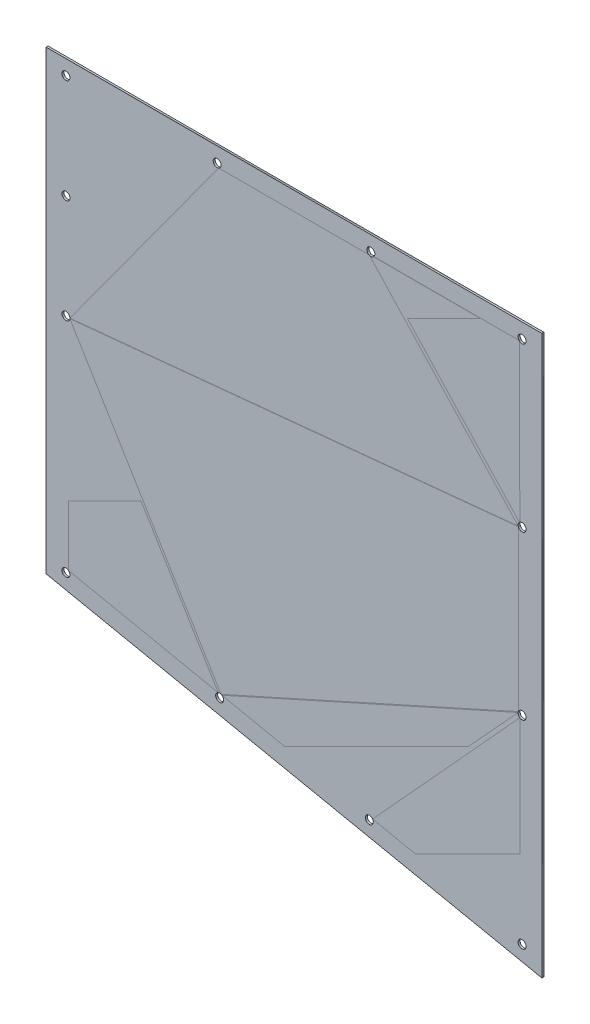
ISO-10303-21;
HEADER;
FILE_DESCRIPTION(('STEP AP214'),'2;1');
FILE_NAME('part.step','',(''),(''),'','','');
FILE_SCHEMA(('AUTOMOTIVE_DESIGN { 1 0 10303 214 1 1 1 1 }'));
ENDSEC;
DATA;
#1=APPLICATION_CONTEXT('core data for automotive mechanical design processes');
#2=APPLICATION_PROTOCOL_DEFINITION('international standard','automotive_design',2000,#1);
#3=PRODUCT_CONTEXT('',#1,'mechanical');
#4=PRODUCT('Part','Part','',(#3));
#5=PRODUCT_RELATED_PRODUCT_CATEGORY('part','',(#4));
#6=PRODUCT_DEFINITION_FORMATION('','',#4);
#7=PRODUCT_DEFINITION_CONTEXT('part definition',#1,'design');
#8=PRODUCT_DEFINITION('design','',#6,#7);
#9=PRODUCT_DEFINITION_SHAPE('','',#8);
#10=(LENGTH_UNIT() NAMED_UNIT(*) SI_UNIT(.MILLI.,.METRE.));
#11=(NAMED_UNIT(*) PLANE_ANGLE_UNIT() SI_UNIT($,.RADIAN.));
#12=(NAMED_UNIT(*) SI_UNIT($,.STERADIAN.) SOLID_ANGLE_UNIT());
#13=UNCERTAINTY_MEASURE_WITH_UNIT(LENGTH_MEASURE(1.E-05),#10,'distance_accuracy_value','');
#14=(GEOMETRIC_REPRESENTATION_CONTEXT(3) GLOBAL_UNCERTAINTY_ASSIGNED_CONTEXT((#13)) GLOBAL_UNIT_ASSIGNED_CONTEXT((#10,
#11,#12)) REPRESENTATION_CONTEXT('',''));
#15=CARTESIAN_POINT('',(0.,0.,0.));
#16=DIRECTION('',(0.,0.,1.));
#17=DIRECTION('',(1.,0.,0.));
#18=AXIS2_PLACEMENT_3D('',#15,#16,#17);
#19=CARTESIAN_POINT('',(-250.,0.,2.));
#20=DIRECTION('',(1.,0.,0.));
#21=DIRECTION('',(0.,1.,0.));
#22=AXIS2_PLACEMENT_3D('',#19,#20,#21);
#23=PLANE('',#22);
#24=DIRECTION('',(0.,-1.,0.));
#25=VECTOR('',#24,1.);
#26=CARTESIAN_POINT('',(-250.,0.,0.));
#27=LINE('',#26,#25);
#28=CARTESIAN_POINT('',(-250.,0.,0.));
#29=VERTEX_POINT('',#28);
#30=CARTESIAN_POINT('',(-250.,-460.,0.));
#31=VERTEX_POINT('',#30);
#32=EDGE_CURVE('E105',#29,#31,#27,.T.);
#33=ORIENTED_EDGE('',*,*,#32,.T.);
#34=DIRECTION('',(0.,0.,-1.));
#35=VECTOR('',#34,1.);
#36=CARTESIAN_POINT('',(-250.,-460.,2.));
#37=LINE('',#36,#35);
#38=CARTESIAN_POINT('',(-250.,-460.,2.));
#39=VERTEX_POINT('',#38);
#40=EDGE_CURVE('E12',#39,#31,#37,.T.);
#41=ORIENTED_EDGE('',*,*,#40,.F.);
#42=DIRECTION('',(0.,-1.,0.));
#43=VECTOR('',#42,1.);
#44=CARTESIAN_POINT('',(-250.,0.,2.));
#45=LINE('',#44,#43);
#46=CARTESIAN_POINT('',(-250.,0.,2.));
#47=VERTEX_POINT('',#46);
#48=EDGE_CURVE('E93',#47,#39,#45,.T.);
#49=ORIENTED_EDGE('',*,*,#48,.F.);
#50=DIRECTION('',(0.,0.,-1.));
#51=VECTOR('',#50,1.);
#52=CARTESIAN_POINT('',(-250.,0.,2.));
#53=LINE('',#52,#51);
#54=EDGE_CURVE('E101',#47,#29,#53,.T.);
#55=ORIENTED_EDGE('',*,*,#54,.T.);
#56=EDGE_LOOP('',(#33,#41,#49,#55));
#57=FACE_BOUND('',#56,.T.);
#58=ADVANCED_FACE('F42',(#57),#23,.F.);
#59=CARTESIAN_POINT('',(-250.,-460.,2.));
#60=DIRECTION('',(0.201763461346261,0.97943427837991,0.));
#61=DIRECTION('',(-0.97943427837991,0.201763461346261,0.));
#62=AXIS2_PLACEMENT_3D('',#59,#60,#61);
#63=PLANE('',#62);
#64=DIRECTION('',(0.97943427837991,-0.201763461346261,0.));
#65=VECTOR('',#64,1.);
#66=CARTESIAN_POINT('',(-250.,-460.,0.));
#67=LINE('',#66,#65);
#68=CARTESIAN_POINT('',(250.,-563.,0.));
#69=VERTEX_POINT('',#68);
#70=EDGE_CURVE('E97',#31,#69,#67,.T.);
#71=ORIENTED_EDGE('',*,*,#70,.T.);
#72=DIRECTION('',(0.,0.,-1.));
#73=VECTOR('',#72,1.);
#74=CARTESIAN_POINT('',(250.,-563.,2.));
#75=LINE('',#74,#73);
#76=CARTESIAN_POINT('',(250.,-563.,2.));
#77=VERTEX_POINT('',#76);
#78=EDGE_CURVE('E50',#77,#69,#75,.T.);
#79=ORIENTED_EDGE('',*,*,#78,.F.);
#80=DIRECTION('',(0.97943427837991,-0.201763461346261,0.));
#81=VECTOR('',#80,1.);
#82=CARTESIAN_POINT('',(-250.,-460.,2.));
#83=LINE('',#82,#81);
#84=EDGE_CURVE('E88',#39,#77,#83,.T.);
#85=ORIENTED_EDGE('',*,*,#84,.F.);
#86=ORIENTED_EDGE('',*,*,#40,.T.);
#87=EDGE_LOOP('',(#71,#79,#85,#86));
#88=FACE_BOUND('',#87,.T.);
#89=ADVANCED_FACE('F96',(#88),#63,.F.);
#90=CARTESIAN_POINT('',(250.,0.,2.));
#91=DIRECTION('',(-1.,0.,0.));
#92=DIRECTION('',(0.,-1.,0.));
#93=AXIS2_PLACEMENT_3D('',#90,#91,#92);
#94=PLANE('',#93);
#95=DIRECTION('',(0.,1.,0.));
#96=VECTOR('',#95,1.);
#97=CARTESIAN_POINT('',(250.,0.,0.));
#98=LINE('',#97,#96);
#99=CARTESIAN_POINT('',(250.,0.,0.));
#100=VERTEX_POINT('',#99);
#101=EDGE_CURVE('E75',#69,#100,#98,.T.);
#102=ORIENTED_EDGE('',*,*,#101,.T.);
#103=DIRECTION('',(0.,0.,-1.));
#104=VECTOR('',#103,1.);
#105=CARTESIAN_POINT('',(250.,0.,2.));
#106=LINE('',#105,#104);
#107=CARTESIAN_POINT('',(250.,0.,2.));
#108=VERTEX_POINT('',#107);
#109=EDGE_CURVE('E98',#108,#100,#106,.T.);
#110=ORIENTED_EDGE('',*,*,#109,.F.);
#111=DIRECTION('',(0.,1.,0.));
#112=VECTOR('',#111,1.);
#113=CARTESIAN_POINT('',(250.,0.,2.));
#114=LINE('',#113,#112);
#115=EDGE_CURVE('E91',#77,#108,#114,.T.);
#116=ORIENTED_EDGE('',*,*,#115,.F.);
#117=ORIENTED_EDGE('',*,*,#78,.T.);
#118=EDGE_LOOP('',(#102,#110,#116,#117));
#119=FACE_BOUND('',#118,.T.);
#120=ADVANCED_FACE('F99',(#119),#94,.F.);
#121=CARTESIAN_POINT('',(-250.,0.,2.));
#122=DIRECTION('',(0.,-1.,0.));
#123=DIRECTION('',(0.,0.,-1.));
#124=AXIS2_PLACEMENT_3D('',#121,#122,#123);
#125=PLANE('',#124);
#126=DIRECTION('',(-1.,0.,0.));
#127=VECTOR('',#126,1.);
#128=CARTESIAN_POINT('',(-250.,0.,0.));
#129=LINE('',#128,#127);
#130=EDGE_CURVE('E81',#100,#29,#129,.T.);
#131=ORIENTED_EDGE('',*,*,#130,.T.);
#132=ORIENTED_EDGE('',*,*,#54,.F.);
#133=DIRECTION('',(-1.,0.,0.));
#134=VECTOR('',#133,1.);
#135=CARTESIAN_POINT('',(-250.,0.,2.));
#136=LINE('',#135,#134);
#137=EDGE_CURVE('E58',#108,#47,#136,.T.);
#138=ORIENTED_EDGE('',*,*,#137,.F.);
#139=ORIENTED_EDGE('',*,*,#109,.T.);
#140=EDGE_LOOP('',(#131,#132,#138,#139));
#141=FACE_BOUND('',#140,.T.);
#142=ADVANCED_FACE('F113',(#141),#125,.F.);
#143=CARTESIAN_POINT('',(0.,0.,2.));
#144=DIRECTION('',(0.,0.,1.));
#145=DIRECTION('',(1.,0.,0.));
#146=AXIS2_PLACEMENT_3D('',#143,#144,#145);
#147=PLANE('',#146);
#148=CARTESIAN_POINT('',(-230.,-448.805036728741,2.));
#149=DIRECTION('',(0.,0.,1.));
#150=DIRECTION('',(1.,0.,0.));
#151=AXIS2_PLACEMENT_3D('',#148,#149,#150);
#152=CIRCLE('',#151,4.00000000000002);
#153=CARTESIAN_POINT('',(-226.,-448.805036728741,2.));
#154=VERTEX_POINT('',#153);
#155=EDGE_CURVE('E184',#154,#154,#152,.T.);
#156=ORIENTED_EDGE('',*,*,#155,.F.);
#157=EDGE_LOOP('',(#156));
#158=FACE_BOUND('',#157,.T.);
#159=CARTESIAN_POINT('',(230.,-179.282518364371,2.));
#160=DIRECTION('',(0.,0.,1.));
#161=DIRECTION('',(1.,0.,0.));
#162=AXIS2_PLACEMENT_3D('',#159,#160,#161);
#163=CIRCLE('',#162,3.99999999999999);
#164=CARTESIAN_POINT('',(234.,-179.282518364371,2.));
#165=VERTEX_POINT('',#164);
#166=EDGE_CURVE('E178',#165,#165,#163,.T.);
#167=ORIENTED_EDGE('',*,*,#166,.F.);
#168=EDGE_LOOP('',(#167));
#169=FACE_BOUND('',#168,.T.);
#170=CARTESIAN_POINT('',(230.,-343.565036728742,2.));
#171=DIRECTION('',(0.,0.,1.));
#172=DIRECTION('',(1.,0.,0.));
#173=AXIS2_PLACEMENT_3D('',#170,#171,#172);
#174=CIRCLE('',#173,3.99999999999999);
#175=CARTESIAN_POINT('',(234.,-343.565036728742,2.));
#176=VERTEX_POINT('',#175);
#177=EDGE_CURVE('E172',#176,#176,#174,.T.);
#178=ORIENTED_EDGE('',*,*,#177,.F.);
#179=EDGE_LOOP('',(#178));
#180=FACE_BOUND('',#179,.T.);
#181=CARTESIAN_POINT('',(230.,-543.565036728741,2.));
#182=DIRECTION('',(0.,0.,1.));
#183=DIRECTION('',(1.,0.,0.));
#184=AXIS2_PLACEMENT_3D('',#181,#182,#183);
#185=CIRCLE('',#184,3.99999999999999);
#186=CARTESIAN_POINT('',(234.,-543.565036728741,2.));
#187=VERTEX_POINT('',#186);
#188=EDGE_CURVE('E166',#187,#187,#185,.T.);
#189=ORIENTED_EDGE('',*,*,#188,.F.);
#190=EDGE_LOOP('',(#189));
#191=FACE_BOUND('',#190,.T.);
#192=CARTESIAN_POINT('',(75.9604418380151,-511.832887747373,2.));
#193=DIRECTION('',(0.,0.,1.));
#194=DIRECTION('',(1.,0.,0.));
#195=AXIS2_PLACEMENT_3D('',#192,#193,#194);
#196=CIRCLE('',#195,4.00000000000001);
#197=CARTESIAN_POINT('',(79.9604418380151,-511.832887747373,2.));
#198=VERTEX_POINT('',#197);
#199=EDGE_CURVE('E160',#198,#198,#196,.T.);
#200=ORIENTED_EDGE('',*,*,#199,.F.);
#201=EDGE_LOOP('',(#200));
#202=FACE_BOUND('',#201,.T.);
#203=CARTESIAN_POINT('',(-75.0000000000001,-480.735036728741,2.));
#204=DIRECTION('',(0.,0.,1.));
#205=DIRECTION('',(1.,0.,0.));
#206=AXIS2_PLACEMENT_3D('',#203,#204,#205);
#207=CIRCLE('',#206,4.00000000000001);
#208=CARTESIAN_POINT('',(-71.0000000000001,-480.735036728741,2.));
#209=VERTEX_POINT('',#208);
#210=EDGE_CURVE('E154',#209,#209,#207,.T.);
#211=ORIENTED_EDGE('',*,*,#210,.F.);
#212=EDGE_LOOP('',(#211));
#213=FACE_BOUND('',#212,.T.);
#214=CARTESIAN_POINT('',(-230.,-224.715402175545,2.));
#215=DIRECTION('',(0.,0.,1.));
#216=DIRECTION('',(1.,0.,0.));
#217=AXIS2_PLACEMENT_3D('',#214,#215,#216);
#218=CIRCLE('',#217,3.99999999999999);
#219=CARTESIAN_POINT('',(-226.,-224.715402175545,2.));
#220=VERTEX_POINT('',#219);
#221=EDGE_CURVE('E148',#220,#220,#218,.T.);
#222=ORIENTED_EDGE('',*,*,#221,.F.);
#223=EDGE_LOOP('',(#222));
#224=FACE_BOUND('',#223,.T.);
#225=CARTESIAN_POINT('',(-230.,-119.857701087773,2.));
#226=DIRECTION('',(0.,0.,1.));
#227=DIRECTION('',(1.,0.,0.));
#228=AXIS2_PLACEMENT_3D('',#225,#226,#227);
#229=CIRCLE('',#228,4.00000000000002);
#230=CARTESIAN_POINT('',(-226.,-119.857701087773,2.));
#231=VERTEX_POINT('',#230);
#232=EDGE_CURVE('E142',#231,#231,#229,.T.);
#233=ORIENTED_EDGE('',*,*,#232,.F.);
#234=EDGE_LOOP('',(#233));
#235=FACE_BOUND('',#234,.T.);
#236=CARTESIAN_POINT('',(-230.,-15.,2.));
#237=DIRECTION('',(0.,0.,1.));
#238=DIRECTION('',(1.,0.,0.));
#239=AXIS2_PLACEMENT_3D('',#236,#237,#238);
#240=CIRCLE('',#239,3.99999999999999);
#241=CARTESIAN_POINT('',(-226.,-15.,2.));
#242=VERTEX_POINT('',#241);
#243=EDGE_CURVE('E136',#242,#242,#240,.T.);
#244=ORIENTED_EDGE('',*,*,#243,.F.);
#245=EDGE_LOOP('',(#244));
#246=FACE_BOUND('',#245,.T.);
#247=CARTESIAN_POINT('',(-77.5,-15.,2.));
#248=DIRECTION('',(0.,0.,1.));
#249=DIRECTION('',(1.,0.,0.));
#250=AXIS2_PLACEMENT_3D('',#247,#248,#249);
#251=CIRCLE('',#250,4.00000000000001);
#252=CARTESIAN_POINT('',(-73.5,-15.,2.));
#253=VERTEX_POINT('',#252);
#254=EDGE_CURVE('E130',#253,#253,#251,.T.);
#255=ORIENTED_EDGE('',*,*,#254,.F.);
#256=EDGE_LOOP('',(#255));
#257=FACE_BOUND('',#256,.T.);
#258=CARTESIAN_POINT('',(77.5000000000001,-15.,2.));
#259=DIRECTION('',(0.,0.,1.));
#260=DIRECTION('',(1.,0.,0.));
#261=AXIS2_PLACEMENT_3D('',#258,#259,#260);
#262=CIRCLE('',#261,4.00000000000001);
#263=CARTESIAN_POINT('',(81.5000000000001,-15.,2.));
#264=VERTEX_POINT('',#263);
#265=EDGE_CURVE('E124',#264,#264,#262,.T.);
#266=ORIENTED_EDGE('',*,*,#265,.F.);
#267=EDGE_LOOP('',(#266));
#268=FACE_BOUND('',#267,.T.);
#269=CARTESIAN_POINT('',(230.,-15.,2.));
#270=DIRECTION('',(0.,0.,1.));
#271=DIRECTION('',(1.,0.,0.));
#272=AXIS2_PLACEMENT_3D('',#269,#270,#271);
#273=CIRCLE('',#272,3.99999999999999);
#274=CARTESIAN_POINT('',(234.,-15.,2.));
#275=VERTEX_POINT('',#274);
#276=EDGE_CURVE('E108',#275,#275,#273,.T.);
#277=ORIENTED_EDGE('',*,*,#276,.F.);
#278=EDGE_LOOP('',(#277));
#279=FACE_BOUND('',#278,.T.);
#280=ORIENTED_EDGE('',*,*,#48,.T.);
#281=ORIENTED_EDGE('',*,*,#84,.T.);
#282=ORIENTED_EDGE('',*,*,#115,.T.);
#283=ORIENTED_EDGE('',*,*,#137,.T.);
#284=EDGE_LOOP('',(#280,#281,#282,#283));
#285=FACE_BOUND('',#284,.T.);
#286=ADVANCED_FACE('F89',(#158,#169,#180,#191,#202,#213,#224,#235,#246,#257,#268,#279,#285),
#147,.T.);
#287=CARTESIAN_POINT('',(0.,0.,0.));
#288=DIRECTION('',(0.,0.,1.));
#289=DIRECTION('',(1.,0.,0.));
#290=AXIS2_PLACEMENT_3D('',#287,#288,#289);
#291=PLANE('',#290);
#292=CARTESIAN_POINT('',(-230.,-448.805036728741,0.));
#293=DIRECTION('',(0.,0.,-1.));
#294=DIRECTION('',(-1.,0.,0.));
#295=AXIS2_PLACEMENT_3D('',#292,#293,#294);
#296=CIRCLE('',#295,4.00000000000002);
#297=CARTESIAN_POINT('',(-234.,-448.805036728741,0.));
#298=VERTEX_POINT('',#297);
#299=EDGE_CURVE('E187',#298,#298,#296,.T.);
#300=ORIENTED_EDGE('',*,*,#299,.F.);
#301=EDGE_LOOP('',(#300));
#302=FACE_BOUND('',#301,.T.);
#303=CARTESIAN_POINT('',(230.,-179.282518364371,0.));
#304=DIRECTION('',(0.,0.,-1.));
#305=DIRECTION('',(-1.,0.,0.));
#306=AXIS2_PLACEMENT_3D('',#303,#304,#305);
#307=CIRCLE('',#306,3.99999999999999);
#308=CARTESIAN_POINT('',(226.,-179.282518364371,0.));
#309=VERTEX_POINT('',#308);
#310=EDGE_CURVE('E181',#309,#309,#307,.T.);
#311=ORIENTED_EDGE('',*,*,#310,.F.);
#312=EDGE_LOOP('',(#311));
#313=FACE_BOUND('',#312,.T.);
#314=CARTESIAN_POINT('',(230.,-343.565036728742,0.));
#315=DIRECTION('',(0.,0.,-1.));
#316=DIRECTION('',(-1.,0.,0.));
#317=AXIS2_PLACEMENT_3D('',#314,#315,#316);
#318=CIRCLE('',#317,3.99999999999999);
#319=CARTESIAN_POINT('',(226.,-343.565036728742,0.));
#320=VERTEX_POINT('',#319);
#321=EDGE_CURVE('E175',#320,#320,#318,.T.);
#322=ORIENTED_EDGE('',*,*,#321,.F.);
#323=EDGE_LOOP('',(#322));
#324=FACE_BOUND('',#323,.T.);
#325=CARTESIAN_POINT('',(230.,-543.565036728741,0.));
#326=DIRECTION('',(0.,0.,-1.));
#327=DIRECTION('',(-1.,0.,0.));
#328=AXIS2_PLACEMENT_3D('',#325,#326,#327);
#329=CIRCLE('',#328,3.99999999999999);
#330=CARTESIAN_POINT('',(226.,-543.565036728741,0.));
#331=VERTEX_POINT('',#330);
#332=EDGE_CURVE('E169',#331,#331,#329,.T.);
#333=ORIENTED_EDGE('',*,*,#332,.F.);
#334=EDGE_LOOP('',(#333));
#335=FACE_BOUND('',#334,.T.);
#336=CARTESIAN_POINT('',(75.9604418380151,-511.832887747373,0.));
#337=DIRECTION('',(0.,0.,-1.));
#338=DIRECTION('',(-1.,0.,0.));
#339=AXIS2_PLACEMENT_3D('',#336,#337,#338);
#340=CIRCLE('',#339,4.00000000000001);
#341=CARTESIAN_POINT('',(71.9604418380151,-511.832887747373,0.));
#342=VERTEX_POINT('',#341);
#343=EDGE_CURVE('E163',#342,#342,#340,.T.);
#344=ORIENTED_EDGE('',*,*,#343,.F.);
#345=EDGE_LOOP('',(#344));
#346=FACE_BOUND('',#345,.T.);
#347=CARTESIAN_POINT('',(-75.0000000000001,-480.735036728741,0.));
#348=DIRECTION('',(0.,0.,-1.));
#349=DIRECTION('',(-1.,0.,0.));
#350=AXIS2_PLACEMENT_3D('',#347,#348,#349);
#351=CIRCLE('',#350,4.00000000000001);
#352=CARTESIAN_POINT('',(-79.0000000000001,-480.735036728741,0.));
#353=VERTEX_POINT('',#352);
#354=EDGE_CURVE('E157',#353,#353,#351,.T.);
#355=ORIENTED_EDGE('',*,*,#354,.F.);
#356=EDGE_LOOP('',(#355));
#357=FACE_BOUND('',#356,.T.);
#358=CARTESIAN_POINT('',(-230.,-224.715402175545,0.));
#359=DIRECTION('',(0.,0.,-1.));
#360=DIRECTION('',(-1.,0.,0.));
#361=AXIS2_PLACEMENT_3D('',#358,#359,#360);
#362=CIRCLE('',#361,3.99999999999999);
#363=CARTESIAN_POINT('',(-234.,-224.715402175545,0.));
#364=VERTEX_POINT('',#363);
#365=EDGE_CURVE('E151',#364,#364,#362,.T.);
#366=ORIENTED_EDGE('',*,*,#365,.F.);
#367=EDGE_LOOP('',(#366));
#368=FACE_BOUND('',#367,.T.);
#369=CARTESIAN_POINT('',(-230.,-119.857701087773,0.));
#370=DIRECTION('',(0.,0.,-1.));
#371=DIRECTION('',(-1.,0.,0.));
#372=AXIS2_PLACEMENT_3D('',#369,#370,#371);
#373=CIRCLE('',#372,4.00000000000002);
#374=CARTESIAN_POINT('',(-234.,-119.857701087773,0.));
#375=VERTEX_POINT('',#374);
#376=EDGE_CURVE('E145',#375,#375,#373,.T.);
#377=ORIENTED_EDGE('',*,*,#376,.F.);
#378=EDGE_LOOP('',(#377));
#379=FACE_BOUND('',#378,.T.);
#380=CARTESIAN_POINT('',(-230.,-15.,0.));
#381=DIRECTION('',(0.,0.,-1.));
#382=DIRECTION('',(-1.,0.,0.));
#383=AXIS2_PLACEMENT_3D('',#380,#381,#382);
#384=CIRCLE('',#383,3.99999999999999);
#385=CARTESIAN_POINT('',(-234.,-15.,0.));
#386=VERTEX_POINT('',#385);
#387=EDGE_CURVE('E139',#386,#386,#384,.T.);
#388=ORIENTED_EDGE('',*,*,#387,.F.);
#389=EDGE_LOOP('',(#388));
#390=FACE_BOUND('',#389,.T.);
#391=CARTESIAN_POINT('',(-77.5,-15.,0.));
#392=DIRECTION('',(0.,0.,-1.));
#393=DIRECTION('',(-1.,0.,0.));
#394=AXIS2_PLACEMENT_3D('',#391,#392,#393);
#395=CIRCLE('',#394,4.00000000000001);
#396=CARTESIAN_POINT('',(-81.5,-15.,0.));
#397=VERTEX_POINT('',#396);
#398=EDGE_CURVE('E133',#397,#397,#395,.T.);
#399=ORIENTED_EDGE('',*,*,#398,.F.);
#400=EDGE_LOOP('',(#399));
#401=FACE_BOUND('',#400,.T.);
#402=CARTESIAN_POINT('',(77.5000000000001,-15.,0.));
#403=DIRECTION('',(0.,0.,-1.));
#404=DIRECTION('',(-1.,0.,0.));
#405=AXIS2_PLACEMENT_3D('',#402,#403,#404);
#406=CIRCLE('',#405,4.00000000000001);
#407=CARTESIAN_POINT('',(73.5000000000001,-15.,0.));
#408=VERTEX_POINT('',#407);
#409=EDGE_CURVE('E127',#408,#408,#406,.T.);
#410=ORIENTED_EDGE('',*,*,#409,.F.);
#411=EDGE_LOOP('',(#410));
#412=FACE_BOUND('',#411,.T.);
#413=CARTESIAN_POINT('',(230.,-15.,0.));
#414=DIRECTION('',(0.,0.,-1.));
#415=DIRECTION('',(-1.,0.,0.));
#416=AXIS2_PLACEMENT_3D('',#413,#414,#415);
#417=CIRCLE('',#416,3.99999999999999);
#418=CARTESIAN_POINT('',(226.,-15.,0.));
#419=VERTEX_POINT('',#418);
#420=EDGE_CURVE('E121',#419,#419,#417,.T.);
#421=ORIENTED_EDGE('',*,*,#420,.F.);
#422=EDGE_LOOP('',(#421));
#423=FACE_BOUND('',#422,.T.);
#424=ORIENTED_EDGE('',*,*,#32,.F.);
#425=ORIENTED_EDGE('',*,*,#130,.F.);
#426=ORIENTED_EDGE('',*,*,#101,.F.);
#427=ORIENTED_EDGE('',*,*,#70,.F.);
#428=EDGE_LOOP('',(#424,#425,#426,#427));
#429=FACE_BOUND('',#428,.T.);
#430=ADVANCED_FACE('F116',(#302,#313,#324,#335,#346,#357,#368,#379,#390,#401,#412,#423,#429),
#291,.F.);
#431=CARTESIAN_POINT('',(230.,-15.,10.));
#432=DIRECTION('',(0.,0.,-1.));
#433=DIRECTION('',(-1.,0.,0.));
#434=AXIS2_PLACEMENT_3D('',#431,#432,#433);
#435=CYLINDRICAL_SURFACE('',#434,3.99999999999999);
#436=ORIENTED_EDGE('',*,*,#276,.T.);
#437=EDGE_LOOP('',(#436));
#438=FACE_BOUND('',#437,.T.);
#439=ORIENTED_EDGE('',*,*,#420,.T.);
#440=EDGE_LOOP('',(#439));
#441=FACE_BOUND('',#440,.T.);
#442=ADVANCED_FACE('F195',(#438,#441),#435,.F.);
#443=CARTESIAN_POINT('',(77.5000000000001,-15.,10.));
#444=DIRECTION('',(0.,0.,-1.));
#445=DIRECTION('',(-1.,0.,0.));
#446=AXIS2_PLACEMENT_3D('',#443,#444,#445);
#447=CYLINDRICAL_SURFACE('',#446,4.00000000000001);
#448=ORIENTED_EDGE('',*,*,#265,.T.);
#449=EDGE_LOOP('',(#448));
#450=FACE_BOUND('',#449,.T.);
#451=ORIENTED_EDGE('',*,*,#409,.T.);
#452=EDGE_LOOP('',(#451));
#453=FACE_BOUND('',#452,.T.);
#454=ADVANCED_FACE('F220',(#450,#453),#447,.F.);
#455=CARTESIAN_POINT('',(-77.5,-15.,10.));
#456=DIRECTION('',(0.,0.,-1.));
#457=DIRECTION('',(-1.,0.,0.));
#458=AXIS2_PLACEMENT_3D('',#455,#456,#457);
#459=CYLINDRICAL_SURFACE('',#458,4.00000000000001);
#460=ORIENTED_EDGE('',*,*,#254,.T.);
#461=EDGE_LOOP('',(#460));
#462=FACE_BOUND('',#461,.T.);
#463=ORIENTED_EDGE('',*,*,#398,.T.);
#464=EDGE_LOOP('',(#463));
#465=FACE_BOUND('',#464,.T.);
#466=ADVANCED_FACE('F227',(#462,#465),#459,.F.);
#467=CARTESIAN_POINT('',(-230.,-15.,10.));
#468=DIRECTION('',(0.,0.,-1.));
#469=DIRECTION('',(-1.,0.,0.));
#470=AXIS2_PLACEMENT_3D('',#467,#468,#469);
#471=CYLINDRICAL_SURFACE('',#470,3.99999999999999);
#472=ORIENTED_EDGE('',*,*,#243,.T.);
#473=EDGE_LOOP('',(#472));
#474=FACE_BOUND('',#473,.T.);
#475=ORIENTED_EDGE('',*,*,#387,.T.);
#476=EDGE_LOOP('',(#475));
#477=FACE_BOUND('',#476,.T.);
#478=ADVANCED_FACE('F275',(#474,#477),#471,.F.);
#479=CARTESIAN_POINT('',(-230.,-119.857701087773,10.));
#480=DIRECTION('',(0.,0.,-1.));
#481=DIRECTION('',(-1.,0.,0.));
#482=AXIS2_PLACEMENT_3D('',#479,#480,#481);
#483=CYLINDRICAL_SURFACE('',#482,4.00000000000002);
#484=ORIENTED_EDGE('',*,*,#232,.T.);
#485=EDGE_LOOP('',(#484));
#486=FACE_BOUND('',#485,.T.);
#487=ORIENTED_EDGE('',*,*,#376,.T.);
#488=EDGE_LOOP('',(#487));
#489=FACE_BOUND('',#488,.T.);
#490=ADVANCED_FACE('F281',(#486,#489),#483,.F.);
#491=CARTESIAN_POINT('',(-230.,-224.715402175545,10.));
#492=DIRECTION('',(0.,0.,-1.));
#493=DIRECTION('',(-1.,0.,0.));
#494=AXIS2_PLACEMENT_3D('',#491,#492,#493);
#495=CYLINDRICAL_SURFACE('',#494,3.99999999999999);
#496=ORIENTED_EDGE('',*,*,#221,.T.);
#497=EDGE_LOOP('',(#496));
#498=FACE_BOUND('',#497,.T.);
#499=ORIENTED_EDGE('',*,*,#365,.T.);
#500=EDGE_LOOP('',(#499));
#501=FACE_BOUND('',#500,.T.);
#502=ADVANCED_FACE('F287',(#498,#501),#495,.F.);
#503=CARTESIAN_POINT('',(-75.0000000000001,-480.735036728741,10.));
#504=DIRECTION('',(0.,0.,-1.));
#505=DIRECTION('',(-1.,0.,0.));
#506=AXIS2_PLACEMENT_3D('',#503,#504,#505);
#507=CYLINDRICAL_SURFACE('',#506,4.00000000000001);
#508=ORIENTED_EDGE('',*,*,#210,.T.);
#509=EDGE_LOOP('',(#508));
#510=FACE_BOUND('',#509,.T.);
#511=ORIENTED_EDGE('',*,*,#354,.T.);
#512=EDGE_LOOP('',(#511));
#513=FACE_BOUND('',#512,.T.);
#514=ADVANCED_FACE('F291',(#510,#513),#507,.F.);
#515=CARTESIAN_POINT('',(75.9604418380151,-511.832887747373,10.));
#516=DIRECTION('',(0.,0.,-1.));
#517=DIRECTION('',(-1.,0.,0.));
#518=AXIS2_PLACEMENT_3D('',#515,#516,#517);
#519=CYLINDRICAL_SURFACE('',#518,4.00000000000001);
#520=ORIENTED_EDGE('',*,*,#199,.T.);
#521=EDGE_LOOP('',(#520));
#522=FACE_BOUND('',#521,.T.);
#523=ORIENTED_EDGE('',*,*,#343,.T.);
#524=EDGE_LOOP('',(#523));
#525=FACE_BOUND('',#524,.T.);
#526=ADVANCED_FACE('F295',(#522,#525),#519,.F.);
#527=CARTESIAN_POINT('',(230.,-543.565036728741,10.));
#528=DIRECTION('',(0.,0.,-1.));
#529=DIRECTION('',(-1.,0.,0.));
#530=AXIS2_PLACEMENT_3D('',#527,#528,#529);
#531=CYLINDRICAL_SURFACE('',#530,3.99999999999999);
#532=ORIENTED_EDGE('',*,*,#188,.T.);
#533=EDGE_LOOP('',(#532));
#534=FACE_BOUND('',#533,.T.);
#535=ORIENTED_EDGE('',*,*,#332,.T.);
#536=EDGE_LOOP('',(#535));
#537=FACE_BOUND('',#536,.T.);
#538=ADVANCED_FACE('F299',(#534,#537),#531,.F.);
#539=CARTESIAN_POINT('',(230.,-343.565036728742,10.));
#540=DIRECTION('',(0.,0.,-1.));
#541=DIRECTION('',(-1.,0.,0.));
#542=AXIS2_PLACEMENT_3D('',#539,#540,#541);
#543=CYLINDRICAL_SURFACE('',#542,3.99999999999999);
#544=ORIENTED_EDGE('',*,*,#177,.T.);
#545=EDGE_LOOP('',(#544));
#546=FACE_BOUND('',#545,.T.);
#547=ORIENTED_EDGE('',*,*,#321,.T.);
#548=EDGE_LOOP('',(#547));
#549=FACE_BOUND('',#548,.T.);
#550=ADVANCED_FACE('F303',(#546,#549),#543,.F.);
#551=CARTESIAN_POINT('',(230.,-179.282518364371,10.));
#552=DIRECTION('',(0.,0.,-1.));
#553=DIRECTION('',(-1.,0.,0.));
#554=AXIS2_PLACEMENT_3D('',#551,#552,#553);
#555=CYLINDRICAL_SURFACE('',#554,3.99999999999999);
#556=ORIENTED_EDGE('',*,*,#166,.T.);
#557=EDGE_LOOP('',(#556));
#558=FACE_BOUND('',#557,.T.);
#559=ORIENTED_EDGE('',*,*,#310,.T.);
#560=EDGE_LOOP('',(#559));
#561=FACE_BOUND('',#560,.T.);
#562=ADVANCED_FACE('F307',(#558,#561),#555,.F.);
#563=CARTESIAN_POINT('',(-230.,-448.805036728741,10.));
#564=DIRECTION('',(0.,0.,-1.));
#565=DIRECTION('',(-1.,0.,0.));
#566=AXIS2_PLACEMENT_3D('',#563,#564,#565);
#567=CYLINDRICAL_SURFACE('',#566,4.00000000000002);
#568=ORIENTED_EDGE('',*,*,#155,.T.);
#569=EDGE_LOOP('',(#568));
#570=FACE_BOUND('',#569,.T.);
#571=ORIENTED_EDGE('',*,*,#299,.T.);
#572=EDGE_LOOP('',(#571));
#573=FACE_BOUND('',#572,.T.);
#574=ADVANCED_FACE('F191',(#570,#573),#567,.F.);
#575=CLOSED_SHELL('',(#58,#89,#120,#142,#286,#430,#442,#454,#466,#478,#490,#502,#514,#526,#538,
#550,#562,#574));
#576=MANIFOLD_SOLID_BREP('B2',#575);
#577=CARTESIAN_POINT('',(-250.,0.,2.));
#578=DIRECTION('',(1.,0.,0.));
#579=DIRECTION('',(0.,1.,0.));
#580=AXIS2_PLACEMENT_3D('',#577,#578,#579);
#581=PLANE('',#580);
#582=DIRECTION('',(0.,-1.,0.));
#583=VECTOR('',#582,1.);
#584=CARTESIAN_POINT('',(-250.,0.,0.));
#585=LINE('',#584,#583);
#586=CARTESIAN_POINT('',(-250.,0.,0.));
#587=VERTEX_POINT('',#586);
#588=CARTESIAN_POINT('',(-250.,-460.,0.));
#589=VERTEX_POINT('',#588);
#590=EDGE_CURVE('E480',#587,#589,#585,.T.);
#591=ORIENTED_EDGE('',*,*,#590,.T.);
#592=DIRECTION('',(0.,0.,-1.));
#593=VECTOR('',#592,1.);
#594=CARTESIAN_POINT('',(-250.,-460.,2.));
#595=LINE('',#594,#593);
#596=CARTESIAN_POINT('',(-250.,-460.,2.));
#597=VERTEX_POINT('',#596);
#598=EDGE_CURVE('E40',#597,#589,#595,.T.);
#599=ORIENTED_EDGE('',*,*,#598,.F.);
#600=DIRECTION('',(0.,-1.,0.));
#601=VECTOR('',#600,1.);
#602=CARTESIAN_POINT('',(-250.,0.,2.));
#603=LINE('',#602,#601);
#604=CARTESIAN_POINT('',(-250.,0.,2.));
#605=VERTEX_POINT('',#604);
#606=EDGE_CURVE('E468',#605,#597,#603,.T.);
#607=ORIENTED_EDGE('',*,*,#606,.F.);
#608=DIRECTION('',(0.,0.,-1.));
#609=VECTOR('',#608,1.);
#610=CARTESIAN_POINT('',(-250.,0.,2.));
#611=LINE('',#610,#609);
#612=EDGE_CURVE('E476',#605,#587,#611,.T.);
#613=ORIENTED_EDGE('',*,*,#612,.T.);
#614=EDGE_LOOP('',(#591,#599,#607,#613));
#615=FACE_BOUND('',#614,.T.);
#616=ADVANCED_FACE('F417',(#615),#581,.F.);
#617=CARTESIAN_POINT('',(-250.,-460.,2.));
#618=DIRECTION('',(0.201763461346261,0.97943427837991,0.));
#619=DIRECTION('',(-0.97943427837991,0.201763461346261,0.));
#620=AXIS2_PLACEMENT_3D('',#617,#618,#619);
#621=PLANE('',#620);
#622=DIRECTION('',(0.97943427837991,-0.201763461346261,0.));
#623=VECTOR('',#622,1.);
#624=CARTESIAN_POINT('',(-250.,-460.,0.));
#625=LINE('',#624,#623);
#626=CARTESIAN_POINT('',(250.,-563.,0.));
#627=VERTEX_POINT('',#626);
#628=EDGE_CURVE('E472',#589,#627,#625,.T.);
#629=ORIENTED_EDGE('',*,*,#628,.T.);
#630=DIRECTION('',(0.,0.,-1.));
#631=VECTOR('',#630,1.);
#632=CARTESIAN_POINT('',(250.,-563.,2.));
#633=LINE('',#632,#631);
#634=CARTESIAN_POINT('',(250.,-563.,2.));
#635=VERTEX_POINT('',#634);
#636=EDGE_CURVE('E425',#635,#627,#633,.T.);
#637=ORIENTED_EDGE('',*,*,#636,.F.);
#638=DIRECTION('',(0.97943427837991,-0.201763461346261,0.));
#639=VECTOR('',#638,1.);
#640=CARTESIAN_POINT('',(-250.,-460.,2.));
#641=LINE('',#640,#639);
#642=EDGE_CURVE('E463',#597,#635,#641,.T.);
#643=ORIENTED_EDGE('',*,*,#642,.F.);
#644=ORIENTED_EDGE('',*,*,#598,.T.);
#645=EDGE_LOOP('',(#629,#637,#643,#644));
#646=FACE_BOUND('',#645,.T.);
#647=ADVANCED_FACE('F471',(#646),#621,.F.);
#648=CARTESIAN_POINT('',(250.,0.,2.));
#649=DIRECTION('',(-1.,0.,0.));
#650=DIRECTION('',(0.,-1.,0.));
#651=AXIS2_PLACEMENT_3D('',#648,#649,#650);
#652=PLANE('',#651);
#653=DIRECTION('',(0.,1.,0.));
#654=VECTOR('',#653,1.);
#655=CARTESIAN_POINT('',(250.,0.,0.));
#656=LINE('',#655,#654);
#657=CARTESIAN_POINT('',(250.,0.,0.));
#658=VERTEX_POINT('',#657);
#659=EDGE_CURVE('E450',#627,#658,#656,.T.);
#660=ORIENTED_EDGE('',*,*,#659,.T.);
#661=DIRECTION('',(0.,0.,-1.));
#662=VECTOR('',#661,1.);
#663=CARTESIAN_POINT('',(250.,0.,2.));
#664=LINE('',#663,#662);
#665=CARTESIAN_POINT('',(250.,0.,2.));
#666=VERTEX_POINT('',#665);
#667=EDGE_CURVE('E473',#666,#658,#664,.T.);
#668=ORIENTED_EDGE('',*,*,#667,.F.);
#669=DIRECTION('',(0.,1.,0.));
#670=VECTOR('',#669,1.);
#671=CARTESIAN_POINT('',(250.,0.,2.));
#672=LINE('',#671,#670);
#673=EDGE_CURVE('E466',#635,#666,#672,.T.);
#674=ORIENTED_EDGE('',*,*,#673,.F.);
#675=ORIENTED_EDGE('',*,*,#636,.T.);
#676=EDGE_LOOP('',(#660,#668,#674,#675));
#677=FACE_BOUND('',#676,.T.);
#678=ADVANCED_FACE('F474',(#677),#652,.F.);
#679=CARTESIAN_POINT('',(-250.,0.,2.));
#680=DIRECTION('',(0.,-1.,0.));
#681=DIRECTION('',(0.,0.,-1.));
#682=AXIS2_PLACEMENT_3D('',#679,#680,#681);
#683=PLANE('',#682);
#684=DIRECTION('',(-1.,0.,0.));
#685=VECTOR('',#684,1.);
#686=CARTESIAN_POINT('',(-250.,0.,0.));
#687=LINE('',#686,#685);
#688=EDGE_CURVE('E456',#658,#587,#687,.T.);
#689=ORIENTED_EDGE('',*,*,#688,.T.);
#690=ORIENTED_EDGE('',*,*,#612,.F.);
#691=DIRECTION('',(-1.,0.,0.));
#692=VECTOR('',#691,1.);
#693=CARTESIAN_POINT('',(-250.,0.,2.));
#694=LINE('',#693,#692);
#695=EDGE_CURVE('E433',#666,#605,#694,.T.);
#696=ORIENTED_EDGE('',*,*,#695,.F.);
#697=ORIENTED_EDGE('',*,*,#667,.T.);
#698=EDGE_LOOP('',(#689,#690,#696,#697));
#699=FACE_BOUND('',#698,.T.);
#700=ADVANCED_FACE('F488',(#699),#683,.F.);
#701=CARTESIAN_POINT('',(0.,0.,2.));
#702=DIRECTION('',(0.,0.,1.));
#703=DIRECTION('',(1.,0.,0.));
#704=AXIS2_PLACEMENT_3D('',#701,#702,#703);
#705=PLANE('',#704);
#706=CARTESIAN_POINT('',(-230.,-448.805036728741,2.));
#707=DIRECTION('',(0.,0.,1.));
#708=DIRECTION('',(1.,0.,0.));
#709=AXIS2_PLACEMENT_3D('',#706,#707,#708);
#710=CIRCLE('',#709,4.00000000000002);
#711=CARTESIAN_POINT('',(-226.,-448.805036728741,2.));
#712=VERTEX_POINT('',#711);
#713=EDGE_CURVE('E559',#712,#712,#710,.T.);
#714=ORIENTED_EDGE('',*,*,#713,.F.);
#715=EDGE_LOOP('',(#714));
#716=FACE_BOUND('',#715,.T.);
#717=CARTESIAN_POINT('',(230.,-179.282518364371,2.));
#718=DIRECTION('',(0.,0.,1.));
#719=DIRECTION('',(1.,0.,0.));
#720=AXIS2_PLACEMENT_3D('',#717,#718,#719);
#721=CIRCLE('',#720,3.99999999999999);
#722=CARTESIAN_POINT('',(234.,-179.282518364371,2.));
#723=VERTEX_POINT('',#722);
#724=EDGE_CURVE('E553',#723,#723,#721,.T.);
#725=ORIENTED_EDGE('',*,*,#724,.F.);
#726=EDGE_LOOP('',(#725));
#727=FACE_BOUND('',#726,.T.);
#728=CARTESIAN_POINT('',(230.,-343.565036728742,2.));
#729=DIRECTION('',(0.,0.,1.));
#730=DIRECTION('',(1.,0.,0.));
#731=AXIS2_PLACEMENT_3D('',#728,#729,#730);
#732=CIRCLE('',#731,3.99999999999999);
#733=CARTESIAN_POINT('',(234.,-343.565036728742,2.));
#734=VERTEX_POINT('',#733);
#735=EDGE_CURVE('E547',#734,#734,#732,.T.);
#736=ORIENTED_EDGE('',*,*,#735,.F.);
#737=EDGE_LOOP('',(#736));
#738=FACE_BOUND('',#737,.T.);
#739=CARTESIAN_POINT('',(230.,-543.565036728741,2.));
#740=DIRECTION('',(0.,0.,1.));
#741=DIRECTION('',(1.,0.,0.));
#742=AXIS2_PLACEMENT_3D('',#739,#740,#741);
#743=CIRCLE('',#742,3.99999999999999);
#744=CARTESIAN_POINT('',(234.,-543.565036728741,2.));
#745=VERTEX_POINT('',#744);
#746=EDGE_CURVE('E541',#745,#745,#743,.T.);
#747=ORIENTED_EDGE('',*,*,#746,.F.);
#748=EDGE_LOOP('',(#747));
#749=FACE_BOUND('',#748,.T.);
#750=CARTESIAN_POINT('',(75.9604418380151,-511.832887747373,2.));
#751=DIRECTION('',(0.,0.,1.));
#752=DIRECTION('',(1.,0.,0.));
#753=AXIS2_PLACEMENT_3D('',#750,#751,#752);
#754=CIRCLE('',#753,4.00000000000001);
#755=CARTESIAN_POINT('',(79.9604418380151,-511.832887747373,2.));
#756=VERTEX_POINT('',#755);
#757=EDGE_CURVE('E535',#756,#756,#754,.T.);
#758=ORIENTED_EDGE('',*,*,#757,.F.);
#759=EDGE_LOOP('',(#758));
#760=FACE_BOUND('',#759,.T.);
#761=CARTESIAN_POINT('',(-75.0000000000001,-480.735036728741,2.));
#762=DIRECTION('',(0.,0.,1.));
#763=DIRECTION('',(1.,0.,0.));
#764=AXIS2_PLACEMENT_3D('',#761,#762,#763);
#765=CIRCLE('',#764,4.00000000000001);
#766=CARTESIAN_POINT('',(-71.0000000000001,-480.735036728741,2.));
#767=VERTEX_POINT('',#766);
#768=EDGE_CURVE('E529',#767,#767,#765,.T.);
#769=ORIENTED_EDGE('',*,*,#768,.F.);
#770=EDGE_LOOP('',(#769));
#771=FACE_BOUND('',#770,.T.);
#772=CARTESIAN_POINT('',(-230.,-224.715402175545,2.));
#773=DIRECTION('',(0.,0.,1.));
#774=DIRECTION('',(1.,0.,0.));
#775=AXIS2_PLACEMENT_3D('',#772,#773,#774);
#776=CIRCLE('',#775,3.99999999999999);
#777=CARTESIAN_POINT('',(-226.,-224.715402175545,2.));
#778=VERTEX_POINT('',#777);
#779=EDGE_CURVE('E523',#778,#778,#776,.T.);
#780=ORIENTED_EDGE('',*,*,#779,.F.);
#781=EDGE_LOOP('',(#780));
#782=FACE_BOUND('',#781,.T.);
#783=CARTESIAN_POINT('',(-230.,-119.857701087773,2.));
#784=DIRECTION('',(0.,0.,1.));
#785=DIRECTION('',(1.,0.,0.));
#786=AXIS2_PLACEMENT_3D('',#783,#784,#785);
#787=CIRCLE('',#786,4.00000000000002);
#788=CARTESIAN_POINT('',(-226.,-119.857701087773,2.));
#789=VERTEX_POINT('',#788);
#790=EDGE_CURVE('E517',#789,#789,#787,.T.);
#791=ORIENTED_EDGE('',*,*,#790,.F.);
#792=EDGE_LOOP('',(#791));
#793=FACE_BOUND('',#792,.T.);
#794=CARTESIAN_POINT('',(-230.,-15.,2.));
#795=DIRECTION('',(0.,0.,1.));
#796=DIRECTION('',(1.,0.,0.));
#797=AXIS2_PLACEMENT_3D('',#794,#795,#796);
#798=CIRCLE('',#797,3.99999999999999);
#799=CARTESIAN_POINT('',(-226.,-15.,2.));
#800=VERTEX_POINT('',#799);
#801=EDGE_CURVE('E511',#800,#800,#798,.T.);
#802=ORIENTED_EDGE('',*,*,#801,.F.);
#803=EDGE_LOOP('',(#802));
#804=FACE_BOUND('',#803,.T.);
#805=CARTESIAN_POINT('',(-77.5,-15.,2.));
#806=DIRECTION('',(0.,0.,1.));
#807=DIRECTION('',(1.,0.,0.));
#808=AXIS2_PLACEMENT_3D('',#805,#806,#807);
#809=CIRCLE('',#808,4.00000000000001);
#810=CARTESIAN_POINT('',(-73.5,-15.,2.));
#811=VERTEX_POINT('',#810);
#812=EDGE_CURVE('E505',#811,#811,#809,.T.);
#813=ORIENTED_EDGE('',*,*,#812,.F.);
#814=EDGE_LOOP('',(#813));
#815=FACE_BOUND('',#814,.T.);
#816=CARTESIAN_POINT('',(77.5000000000001,-15.,2.));
#817=DIRECTION('',(0.,0.,1.));
#818=DIRECTION('',(1.,0.,0.));
#819=AXIS2_PLACEMENT_3D('',#816,#817,#818);
#820=CIRCLE('',#819,4.00000000000001);
#821=CARTESIAN_POINT('',(81.5000000000001,-15.,2.));
#822=VERTEX_POINT('',#821);
#823=EDGE_CURVE('E499',#822,#822,#820,.T.);
#824=ORIENTED_EDGE('',*,*,#823,.F.);
#825=EDGE_LOOP('',(#824));
#826=FACE_BOUND('',#825,.T.);
#827=CARTESIAN_POINT('',(230.,-15.,2.));
#828=DIRECTION('',(0.,0.,1.));
#829=DIRECTION('',(1.,0.,0.));
#830=AXIS2_PLACEMENT_3D('',#827,#828,#829);
#831=CIRCLE('',#830,3.99999999999999);
#832=CARTESIAN_POINT('',(234.,-15.,2.));
#833=VERTEX_POINT('',#832);
#834=EDGE_CURVE('E483',#833,#833,#831,.T.);
#835=ORIENTED_EDGE('',*,*,#834,.F.);
#836=EDGE_LOOP('',(#835));
#837=FACE_BOUND('',#836,.T.);
#838=ORIENTED_EDGE('',*,*,#606,.T.);
#839=ORIENTED_EDGE('',*,*,#642,.T.);
#840=ORIENTED_EDGE('',*,*,#673,.T.);
#841=ORIENTED_EDGE('',*,*,#695,.T.);
#842=EDGE_LOOP('',(#838,#839,#840,#841));
#843=FACE_BOUND('',#842,.T.);
#844=ADVANCED_FACE('F464',(#716,#727,#738,#749,#760,#771,#782,#793,#804,#815,#826,#837,#843),
#705,.T.);
#845=CARTESIAN_POINT('',(0.,0.,0.));
#846=DIRECTION('',(0.,0.,1.));
#847=DIRECTION('',(1.,0.,0.));
#848=AXIS2_PLACEMENT_3D('',#845,#846,#847);
#849=PLANE('',#848);
#850=CARTESIAN_POINT('',(-230.,-448.805036728741,0.));
#851=DIRECTION('',(0.,0.,-1.));
#852=DIRECTION('',(-1.,0.,0.));
#853=AXIS2_PLACEMENT_3D('',#850,#851,#852);
#854=CIRCLE('',#853,4.00000000000002);
#855=CARTESIAN_POINT('',(-234.,-448.805036728741,0.));
#856=VERTEX_POINT('',#855);
#857=EDGE_CURVE('E562',#856,#856,#854,.T.);
#858=ORIENTED_EDGE('',*,*,#857,.F.);
#859=EDGE_LOOP('',(#858));
#860=FACE_BOUND('',#859,.T.);
#861=CARTESIAN_POINT('',(230.,-179.282518364371,0.));
#862=DIRECTION('',(0.,0.,-1.));
#863=DIRECTION('',(-1.,0.,0.));
#864=AXIS2_PLACEMENT_3D('',#861,#862,#863);
#865=CIRCLE('',#864,3.99999999999999);
#866=CARTESIAN_POINT('',(226.,-179.282518364371,0.));
#867=VERTEX_POINT('',#866);
#868=EDGE_CURVE('E556',#867,#867,#865,.T.);
#869=ORIENTED_EDGE('',*,*,#868,.F.);
#870=EDGE_LOOP('',(#869));
#871=FACE_BOUND('',#870,.T.);
#872=CARTESIAN_POINT('',(230.,-343.565036728742,0.));
#873=DIRECTION('',(0.,0.,-1.));
#874=DIRECTION('',(-1.,0.,0.));
#875=AXIS2_PLACEMENT_3D('',#872,#873,#874);
#876=CIRCLE('',#875,3.99999999999999);
#877=CARTESIAN_POINT('',(226.,-343.565036728742,0.));
#878=VERTEX_POINT('',#877);
#879=EDGE_CURVE('E550',#878,#878,#876,.T.);
#880=ORIENTED_EDGE('',*,*,#879,.F.);
#881=EDGE_LOOP('',(#880));
#882=FACE_BOUND('',#881,.T.);
#883=CARTESIAN_POINT('',(230.,-543.565036728741,0.));
#884=DIRECTION('',(0.,0.,-1.));
#885=DIRECTION('',(-1.,0.,0.));
#886=AXIS2_PLACEMENT_3D('',#883,#884,#885);
#887=CIRCLE('',#886,3.99999999999999);
#888=CARTESIAN_POINT('',(226.,-543.565036728741,0.));
#889=VERTEX_POINT('',#888);
#890=EDGE_CURVE('E544',#889,#889,#887,.T.);
#891=ORIENTED_EDGE('',*,*,#890,.F.);
#892=EDGE_LOOP('',(#891));
#893=FACE_BOUND('',#892,.T.);
#894=CARTESIAN_POINT('',(75.9604418380151,-511.832887747373,0.));
#895=DIRECTION('',(0.,0.,-1.));
#896=DIRECTION('',(-1.,0.,0.));
#897=AXIS2_PLACEMENT_3D('',#894,#895,#896);
#898=CIRCLE('',#897,4.00000000000001);
#899=CARTESIAN_POINT('',(71.9604418380151,-511.832887747373,0.));
#900=VERTEX_POINT('',#899);
#901=EDGE_CURVE('E538',#900,#900,#898,.T.);
#902=ORIENTED_EDGE('',*,*,#901,.F.);
#903=EDGE_LOOP('',(#902));
#904=FACE_BOUND('',#903,.T.);
#905=CARTESIAN_POINT('',(-75.0000000000001,-480.735036728741,0.));
#906=DIRECTION('',(0.,0.,-1.));
#907=DIRECTION('',(-1.,0.,0.));
#908=AXIS2_PLACEMENT_3D('',#905,#906,#907);
#909=CIRCLE('',#908,4.00000000000001);
#910=CARTESIAN_POINT('',(-79.0000000000001,-480.735036728741,0.));
#911=VERTEX_POINT('',#910);
#912=EDGE_CURVE('E532',#911,#911,#909,.T.);
#913=ORIENTED_EDGE('',*,*,#912,.F.);
#914=EDGE_LOOP('',(#913));
#915=FACE_BOUND('',#914,.T.);
#916=CARTESIAN_POINT('',(-230.,-224.715402175545,0.));
#917=DIRECTION('',(0.,0.,-1.));
#918=DIRECTION('',(-1.,0.,0.));
#919=AXIS2_PLACEMENT_3D('',#916,#917,#918);
#920=CIRCLE('',#919,3.99999999999999);
#921=CARTESIAN_POINT('',(-234.,-224.715402175545,0.));
#922=VERTEX_POINT('',#921);
#923=EDGE_CURVE('E526',#922,#922,#920,.T.);
#924=ORIENTED_EDGE('',*,*,#923,.F.);
#925=EDGE_LOOP('',(#924));
#926=FACE_BOUND('',#925,.T.);
#927=CARTESIAN_POINT('',(-230.,-119.857701087773,0.));
#928=DIRECTION('',(0.,0.,-1.));
#929=DIRECTION('',(-1.,0.,0.));
#930=AXIS2_PLACEMENT_3D('',#927,#928,#929);
#931=CIRCLE('',#930,4.00000000000002);
#932=CARTESIAN_POINT('',(-234.,-119.857701087773,0.));
#933=VERTEX_POINT('',#932);
#934=EDGE_CURVE('E520',#933,#933,#931,.T.);
#935=ORIENTED_EDGE('',*,*,#934,.F.);
#936=EDGE_LOOP('',(#935));
#937=FACE_BOUND('',#936,.T.);
#938=CARTESIAN_POINT('',(-230.,-15.,0.));
#939=DIRECTION('',(0.,0.,-1.));
#940=DIRECTION('',(-1.,0.,0.));
#941=AXIS2_PLACEMENT_3D('',#938,#939,#940);
#942=CIRCLE('',#941,3.99999999999999);
#943=CARTESIAN_POINT('',(-234.,-15.,0.));
#944=VERTEX_POINT('',#943);
#945=EDGE_CURVE('E514',#944,#944,#942,.T.);
#946=ORIENTED_EDGE('',*,*,#945,.F.);
#947=EDGE_LOOP('',(#946));
#948=FACE_BOUND('',#947,.T.);
#949=CARTESIAN_POINT('',(-77.5,-15.,0.));
#950=DIRECTION('',(0.,0.,-1.));
#951=DIRECTION('',(-1.,0.,0.));
#952=AXIS2_PLACEMENT_3D('',#949,#950,#951);
#953=CIRCLE('',#952,4.00000000000001);
#954=CARTESIAN_POINT('',(-81.5,-15.,0.));
#955=VERTEX_POINT('',#954);
#956=EDGE_CURVE('E508',#955,#955,#953,.T.);
#957=ORIENTED_EDGE('',*,*,#956,.F.);
#958=EDGE_LOOP('',(#957));
#959=FACE_BOUND('',#958,.T.);
#960=CARTESIAN_POINT('',(77.5000000000001,-15.,0.));
#961=DIRECTION('',(0.,0.,-1.));
#962=DIRECTION('',(-1.,0.,0.));
#963=AXIS2_PLACEMENT_3D('',#960,#961,#962);
#964=CIRCLE('',#963,4.00000000000001);
#965=CARTESIAN_POINT('',(73.5000000000001,-15.,0.));
#966=VERTEX_POINT('',#965);
#967=EDGE_CURVE('E502',#966,#966,#964,.T.);
#968=ORIENTED_EDGE('',*,*,#967,.F.);
#969=EDGE_LOOP('',(#968));
#970=FACE_BOUND('',#969,.T.);
#971=CARTESIAN_POINT('',(230.,-15.,0.));
#972=DIRECTION('',(0.,0.,-1.));
#973=DIRECTION('',(-1.,0.,0.));
#974=AXIS2_PLACEMENT_3D('',#971,#972,#973);
#975=CIRCLE('',#974,3.99999999999999);
#976=CARTESIAN_POINT('',(226.,-15.,0.));
#977=VERTEX_POINT('',#976);
#978=EDGE_CURVE('E496',#977,#977,#975,.T.);
#979=ORIENTED_EDGE('',*,*,#978,.F.);
#980=EDGE_LOOP('',(#979));
#981=FACE_BOUND('',#980,.T.);
#982=ORIENTED_EDGE('',*,*,#590,.F.);
#983=ORIENTED_EDGE('',*,*,#688,.F.);
#984=ORIENTED_EDGE('',*,*,#659,.F.);
#985=ORIENTED_EDGE('',*,*,#628,.F.);
#986=EDGE_LOOP('',(#982,#983,#984,#985));
#987=FACE_BOUND('',#986,.T.);
#988=ADVANCED_FACE('F491',(#860,#871,#882,#893,#904,#915,#926,#937,#948,#959,#970,#981,#987),
#849,.F.);
#989=CARTESIAN_POINT('',(230.,-15.,10.));
#990=DIRECTION('',(0.,0.,-1.));
#991=DIRECTION('',(-1.,0.,0.));
#992=AXIS2_PLACEMENT_3D('',#989,#990,#991);
#993=CYLINDRICAL_SURFACE('',#992,3.99999999999999);
#994=ORIENTED_EDGE('',*,*,#834,.T.);
#995=EDGE_LOOP('',(#994));
#996=FACE_BOUND('',#995,.T.);
#997=ORIENTED_EDGE('',*,*,#978,.T.);
#998=EDGE_LOOP('',(#997));
#999=FACE_BOUND('',#998,.T.);
#1000=ADVANCED_FACE('F570',(#996,#999),#993,.F.);
#1001=CARTESIAN_POINT('',(77.5000000000001,-15.,10.));
#1002=DIRECTION('',(0.,0.,-1.));
#1003=DIRECTION('',(-1.,0.,0.));
#1004=AXIS2_PLACEMENT_3D('',#1001,#1002,#1003);
#1005=CYLINDRICAL_SURFACE('',#1004,4.00000000000001);
#1006=ORIENTED_EDGE('',*,*,#823,.T.);
#1007=EDGE_LOOP('',(#1006));
#1008=FACE_BOUND('',#1007,.T.);
#1009=ORIENTED_EDGE('',*,*,#967,.T.);
#1010=EDGE_LOOP('',(#1009));
#1011=FACE_BOUND('',#1010,.T.);
#1012=ADVANCED_FACE('F595',(#1008,#1011),#1005,.F.);
#1013=CARTESIAN_POINT('',(-77.5,-15.,10.));
#1014=DIRECTION('',(0.,0.,-1.));
#1015=DIRECTION('',(-1.,0.,0.));
#1016=AXIS2_PLACEMENT_3D('',#1013,#1014,#1015);
#1017=CYLINDRICAL_SURFACE('',#1016,4.00000000000001);
#1018=ORIENTED_EDGE('',*,*,#812,.T.);
#1019=EDGE_LOOP('',(#1018));
#1020=FACE_BOUND('',#1019,.T.);
#1021=ORIENTED_EDGE('',*,*,#956,.T.);
#1022=EDGE_LOOP('',(#1021));
#1023=FACE_BOUND('',#1022,.T.);
#1024=ADVANCED_FACE('F602',(#1020,#1023),#1017,.F.);
#1025=CARTESIAN_POINT('',(-230.,-15.,10.));
#1026=DIRECTION('',(0.,0.,-1.));
#1027=DIRECTION('',(-1.,0.,0.));
#1028=AXIS2_PLACEMENT_3D('',#1025,#1026,#1027);
#1029=CYLINDRICAL_SURFACE('',#1028,3.99999999999999);
#1030=ORIENTED_EDGE('',*,*,#801,.T.);
#1031=EDGE_LOOP('',(#1030));
#1032=FACE_BOUND('',#1031,.T.);
#1033=ORIENTED_EDGE('',*,*,#945,.T.);
#1034=EDGE_LOOP('',(#1033));
#1035=FACE_BOUND('',#1034,.T.);
#1036=ADVANCED_FACE('F650',(#1032,#1035),#1029,.F.);
#1037=CARTESIAN_POINT('',(-230.,-119.857701087773,10.));
#1038=DIRECTION('',(0.,0.,-1.));
#1039=DIRECTION('',(-1.,0.,0.));
#1040=AXIS2_PLACEMENT_3D('',#1037,#1038,#1039);
#1041=CYLINDRICAL_SURFACE('',#1040,4.00000000000002);
#1042=ORIENTED_EDGE('',*,*,#790,.T.);
#1043=EDGE_LOOP('',(#1042));
#1044=FACE_BOUND('',#1043,.T.);
#1045=ORIENTED_EDGE('',*,*,#934,.T.);
#1046=EDGE_LOOP('',(#1045));
#1047=FACE_BOUND('',#1046,.T.);
#1048=ADVANCED_FACE('F656',(#1044,#1047),#1041,.F.);
#1049=CARTESIAN_POINT('',(-230.,-224.715402175545,10.));
#1050=DIRECTION('',(0.,0.,-1.));
#1051=DIRECTION('',(-1.,0.,0.));
#1052=AXIS2_PLACEMENT_3D('',#1049,#1050,#1051);
#1053=CYLINDRICAL_SURFACE('',#1052,3.99999999999999);
#1054=ORIENTED_EDGE('',*,*,#779,.T.);
#1055=EDGE_LOOP('',(#1054));
#1056=FACE_BOUND('',#1055,.T.);
#1057=ORIENTED_EDGE('',*,*,#923,.T.);
#1058=EDGE_LOOP('',(#1057));
#1059=FACE_BOUND('',#1058,.T.);
#1060=ADVANCED_FACE('F662',(#1056,#1059),#1053,.F.);
#1061=CARTESIAN_POINT('',(-75.0000000000001,-480.735036728741,10.));
#1062=DIRECTION('',(0.,0.,-1.));
#1063=DIRECTION('',(-1.,0.,0.));
#1064=AXIS2_PLACEMENT_3D('',#1061,#1062,#1063);
#1065=CYLINDRICAL_SURFACE('',#1064,4.00000000000001);
#1066=ORIENTED_EDGE('',*,*,#768,.T.);
#1067=EDGE_LOOP('',(#1066));
#1068=FACE_BOUND('',#1067,.T.);
#1069=ORIENTED_EDGE('',*,*,#912,.T.);
#1070=EDGE_LOOP('',(#1069));
#1071=FACE_BOUND('',#1070,.T.);
#1072=ADVANCED_FACE('F666',(#1068,#1071),#1065,.F.);
#1073=CARTESIAN_POINT('',(75.9604418380151,-511.832887747373,10.));
#1074=DIRECTION('',(0.,0.,-1.));
#1075=DIRECTION('',(-1.,0.,0.));
#1076=AXIS2_PLACEMENT_3D('',#1073,#1074,#1075);
#1077=CYLINDRICAL_SURFACE('',#1076,4.00000000000001);
#1078=ORIENTED_EDGE('',*,*,#757,.T.);
#1079=EDGE_LOOP('',(#1078));
#1080=FACE_BOUND('',#1079,.T.);
#1081=ORIENTED_EDGE('',*,*,#901,.T.);
#1082=EDGE_LOOP('',(#1081));
#1083=FACE_BOUND('',#1082,.T.);
#1084=ADVANCED_FACE('F670',(#1080,#1083),#1077,.F.);
#1085=CARTESIAN_POINT('',(230.,-543.565036728741,10.));
#1086=DIRECTION('',(0.,0.,-1.));
#1087=DIRECTION('',(-1.,0.,0.));
#1088=AXIS2_PLACEMENT_3D('',#1085,#1086,#1087);
#1089=CYLINDRICAL_SURFACE('',#1088,3.99999999999999);
#1090=ORIENTED_EDGE('',*,*,#746,.T.);
#1091=EDGE_LOOP('',(#1090));
#1092=FACE_BOUND('',#1091,.T.);
#1093=ORIENTED_EDGE('',*,*,#890,.T.);
#1094=EDGE_LOOP('',(#1093));
#1095=FACE_BOUND('',#1094,.T.);
#1096=ADVANCED_FACE('F674',(#1092,#1095),#1089,.F.);
#1097=CARTESIAN_POINT('',(230.,-343.565036728742,10.));
#1098=DIRECTION('',(0.,0.,-1.));
#1099=DIRECTION('',(-1.,0.,0.));
#1100=AXIS2_PLACEMENT_3D('',#1097,#1098,#1099);
#1101=CYLINDRICAL_SURFACE('',#1100,3.99999999999999);
#1102=ORIENTED_EDGE('',*,*,#735,.T.);
#1103=EDGE_LOOP('',(#1102));
#1104=FACE_BOUND('',#1103,.T.);
#1105=ORIENTED_EDGE('',*,*,#879,.T.);
#1106=EDGE_LOOP('',(#1105));
#1107=FACE_BOUND('',#1106,.T.);
#1108=ADVANCED_FACE('F678',(#1104,#1107),#1101,.F.);
#1109=CARTESIAN_POINT('',(230.,-179.282518364371,10.));
#1110=DIRECTION('',(0.,0.,-1.));
#1111=DIRECTION('',(-1.,0.,0.));
#1112=AXIS2_PLACEMENT_3D('',#1109,#1110,#1111);
#1113=CYLINDRICAL_SURFACE('',#1112,3.99999999999999);
#1114=ORIENTED_EDGE('',*,*,#724,.T.);
#1115=EDGE_LOOP('',(#1114));
#1116=FACE_BOUND('',#1115,.T.);
#1117=ORIENTED_EDGE('',*,*,#868,.T.);
#1118=EDGE_LOOP('',(#1117));
#1119=FACE_BOUND('',#1118,.T.);
#1120=ADVANCED_FACE('F682',(#1116,#1119),#1113,.F.);
#1121=CARTESIAN_POINT('',(-230.,-448.805036728741,10.));
#1122=DIRECTION('',(0.,0.,-1.));
#1123=DIRECTION('',(-1.,0.,0.));
#1124=AXIS2_PLACEMENT_3D('',#1121,#1122,#1123);
#1125=CYLINDRICAL_SURFACE('',#1124,4.00000000000002);
#1126=ORIENTED_EDGE('',*,*,#713,.T.);
#1127=EDGE_LOOP('',(#1126));
#1128=FACE_BOUND('',#1127,.T.);
#1129=ORIENTED_EDGE('',*,*,#857,.T.);
#1130=EDGE_LOOP('',(#1129));
#1131=FACE_BOUND('',#1130,.T.);
#1132=ADVANCED_FACE('F566',(#1128,#1131),#1125,.F.);
#1133=CLOSED_SHELL('',(#616,#647,#678,#700,#844,#988,#1000,#1012,#1024,#1036,#1048,#1060,#1072,
#1084,#1096,#1108,#1120,#1132));
#1134=MANIFOLD_SOLID_BREP('B6',#1133);
#1135=ADVANCED_BREP_SHAPE_REPRESENTATION('',(#18,#576,#1134),#14);
#1136=SHAPE_DEFINITION_REPRESENTATION(#9,#1135);
ENDSEC;
END-ISO-10303-21;
